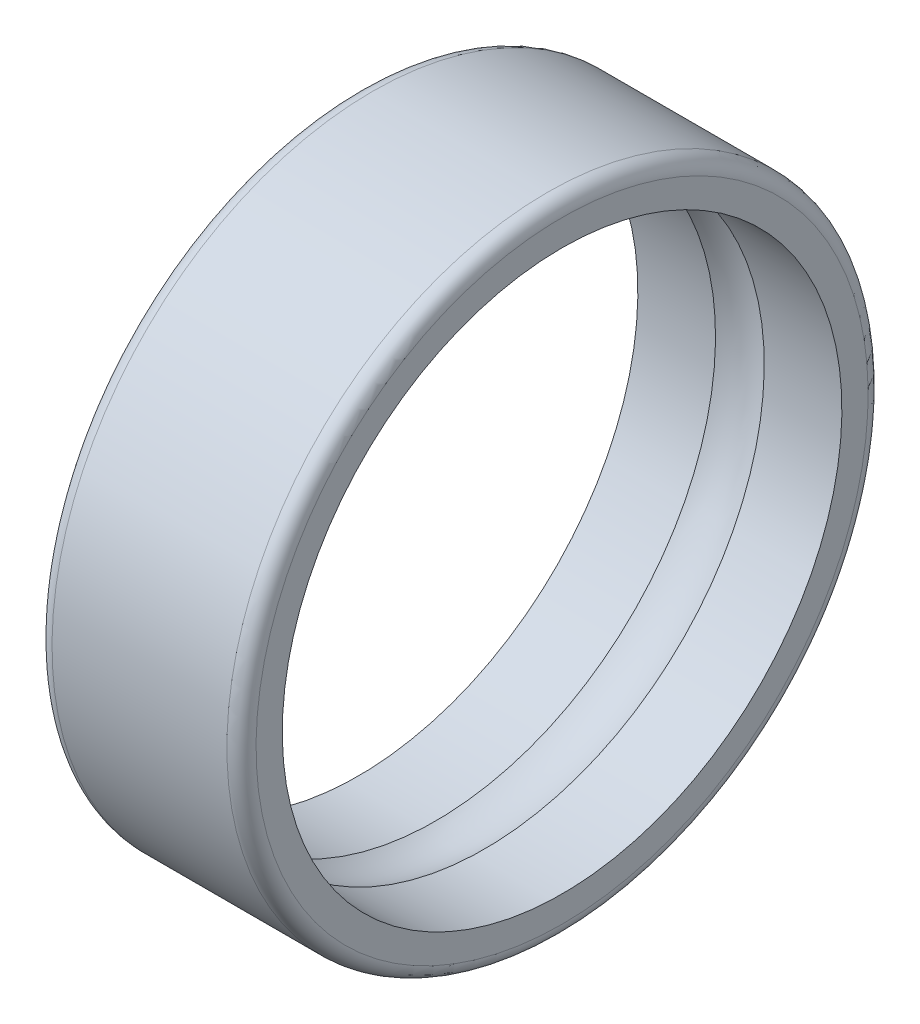
ISO-10303-21;
HEADER;
FILE_DESCRIPTION(('STEP AP214'),'2;1');
FILE_NAME('part.step','',(''),(''),'','','');
FILE_SCHEMA(('AUTOMOTIVE_DESIGN { 1 0 10303 214 1 1 1 1 }'));
ENDSEC;
DATA;
#1=APPLICATION_CONTEXT('core data for automotive mechanical design processes');
#2=APPLICATION_PROTOCOL_DEFINITION('international standard','automotive_design',2000,#1);
#3=PRODUCT_CONTEXT('',#1,'mechanical');
#4=PRODUCT('Part','Part','',(#3));
#5=PRODUCT_RELATED_PRODUCT_CATEGORY('part','',(#4));
#6=PRODUCT_DEFINITION_FORMATION('','',#4);
#7=PRODUCT_DEFINITION_CONTEXT('part definition',#1,'design');
#8=PRODUCT_DEFINITION('design','',#6,#7);
#9=PRODUCT_DEFINITION_SHAPE('','',#8);
#10=(LENGTH_UNIT() NAMED_UNIT(*) SI_UNIT(.MILLI.,.METRE.));
#11=(NAMED_UNIT(*) PLANE_ANGLE_UNIT() SI_UNIT($,.RADIAN.));
#12=(NAMED_UNIT(*) SI_UNIT($,.STERADIAN.) SOLID_ANGLE_UNIT());
#13=UNCERTAINTY_MEASURE_WITH_UNIT(LENGTH_MEASURE(1.E-05),#10,'distance_accuracy_value','');
#14=(GEOMETRIC_REPRESENTATION_CONTEXT(3) GLOBAL_UNCERTAINTY_ASSIGNED_CONTEXT((#13)) GLOBAL_UNIT_ASSIGNED_CONTEXT((#10,
#11,#12)) REPRESENTATION_CONTEXT('',''));
#15=CARTESIAN_POINT('',(0.,0.,0.));
#16=DIRECTION('',(0.,0.,1.));
#17=DIRECTION('',(1.,0.,0.));
#18=AXIS2_PLACEMENT_3D('',#15,#16,#17);
#19=CARTESIAN_POINT('',(0.,0.,0.));
#20=DIRECTION('',(1.,0.,0.));
#21=DIRECTION('',(0.,1.,0.));
#22=AXIS2_PLACEMENT_3D('',#19,#20,#21);
#23=TOROIDAL_SURFACE('',#22,7.8,1.9845);
#24=CARTESIAN_POINT('',(-0.835607712984986,0.,0.));
#25=DIRECTION('',(1.,0.,0.));
#26=DIRECTION('',(0.,1.,0.));
#27=AXIS2_PLACEMENT_3D('',#24,#25,#26);
#28=CIRCLE('',#27,9.6);
#29=CARTESIAN_POINT('',(-0.835607712984987,9.6,0.));
#30=VERTEX_POINT('',#29);
#31=EDGE_CURVE('E64',#30,#30,#28,.T.);
#32=ORIENTED_EDGE('',*,*,#31,.F.);
#33=EDGE_LOOP('',(#32));
#34=FACE_BOUND('',#33,.T.);
#35=CARTESIAN_POINT('',(0.835607712984986,0.,0.));
#36=DIRECTION('',(1.,0.,0.));
#37=DIRECTION('',(0.,1.,0.));
#38=AXIS2_PLACEMENT_3D('',#35,#36,#37);
#39=CIRCLE('',#38,9.6);
#40=CARTESIAN_POINT('',(0.835607712984984,9.6,0.));
#41=VERTEX_POINT('',#40);
#42=EDGE_CURVE('E55',#41,#41,#39,.T.);
#43=ORIENTED_EDGE('',*,*,#42,.T.);
#44=EDGE_LOOP('',(#43));
#45=FACE_BOUND('',#44,.T.);
#46=ADVANCED_FACE('F35',(#34,#45),#23,.F.);
#47=CARTESIAN_POINT('',(23.6601859567376,0.,0.));
#48=DIRECTION('',(1.,0.,0.));
#49=DIRECTION('',(0.,1.,0.));
#50=AXIS2_PLACEMENT_3D('',#47,#48,#49);
#51=CYLINDRICAL_SURFACE('',#50,9.6);
#52=ORIENTED_EDGE('',*,*,#42,.F.);
#53=EDGE_LOOP('',(#52));
#54=FACE_BOUND('',#53,.T.);
#55=CARTESIAN_POINT('',(3.5,0.,0.));
#56=DIRECTION('',(1.,0.,0.));
#57=DIRECTION('',(0.,1.,0.));
#58=AXIS2_PLACEMENT_3D('',#55,#56,#57);
#59=CIRCLE('',#58,9.6);
#60=CARTESIAN_POINT('',(3.5,9.6,0.));
#61=VERTEX_POINT('',#60);
#62=EDGE_CURVE('E58',#61,#61,#59,.T.);
#63=ORIENTED_EDGE('',*,*,#62,.T.);
#64=EDGE_LOOP('',(#63));
#65=FACE_BOUND('',#64,.T.);
#66=ADVANCED_FACE('F72',(#54,#65),#51,.F.);
#67=CARTESIAN_POINT('',(3.5,0.,0.));
#68=DIRECTION('',(-1.,0.,0.));
#69=DIRECTION('',(0.,-1.,0.));
#70=AXIS2_PLACEMENT_3D('',#67,#68,#69);
#71=PLANE('',#70);
#72=CARTESIAN_POINT('',(3.5,0.,0.));
#73=DIRECTION('',(-1.,0.,0.));
#74=DIRECTION('',(0.,-1.,0.));
#75=AXIS2_PLACEMENT_3D('',#72,#73,#74);
#76=CIRCLE('',#75,10.5);
#77=CARTESIAN_POINT('',(3.5,-10.5,0.));
#78=VERTEX_POINT('',#77);
#79=EDGE_CURVE('E10',#78,#78,#76,.F.);
#80=ORIENTED_EDGE('',*,*,#79,.T.);
#81=EDGE_LOOP('',(#80));
#82=FACE_BOUND('',#81,.T.);
#83=ORIENTED_EDGE('',*,*,#62,.F.);
#84=EDGE_LOOP('',(#83));
#85=FACE_BOUND('',#84,.T.);
#86=ADVANCED_FACE('F78',(#82,#85),#71,.F.);
#87=CARTESIAN_POINT('',(23.6601859567376,0.,0.));
#88=DIRECTION('',(1.,0.,0.));
#89=DIRECTION('',(0.,1.,0.));
#90=AXIS2_PLACEMENT_3D('',#87,#88,#89);
#91=CYLINDRICAL_SURFACE('',#90,11.);
#92=CARTESIAN_POINT('',(-3.,0.,0.));
#93=DIRECTION('',(1.,0.,0.));
#94=DIRECTION('',(0.,1.,0.));
#95=AXIS2_PLACEMENT_3D('',#92,#93,#94);
#96=CIRCLE('',#95,11.);
#97=CARTESIAN_POINT('',(-3.,11.,0.));
#98=VERTEX_POINT('',#97);
#99=EDGE_CURVE('E46',#98,#98,#96,.T.);
#100=ORIENTED_EDGE('',*,*,#99,.T.);
#101=EDGE_LOOP('',(#100));
#102=FACE_BOUND('',#101,.T.);
#103=CARTESIAN_POINT('',(3.,0.,0.));
#104=DIRECTION('',(-1.,0.,0.));
#105=DIRECTION('',(0.,-1.,0.));
#106=AXIS2_PLACEMENT_3D('',#103,#104,#105);
#107=CIRCLE('',#106,11.);
#108=CARTESIAN_POINT('',(3.,-11.,0.));
#109=VERTEX_POINT('',#108);
#110=EDGE_CURVE('E50',#109,#109,#107,.T.);
#111=ORIENTED_EDGE('',*,*,#110,.T.);
#112=EDGE_LOOP('',(#111));
#113=FACE_BOUND('',#112,.T.);
#114=ADVANCED_FACE('F83',(#102,#113),#91,.T.);
#115=CARTESIAN_POINT('',(-3.5,0.,0.));
#116=DIRECTION('',(1.,0.,0.));
#117=DIRECTION('',(0.,1.,0.));
#118=AXIS2_PLACEMENT_3D('',#115,#116,#117);
#119=PLANE('',#118);
#120=CARTESIAN_POINT('',(-3.5,0.,0.));
#121=DIRECTION('',(1.,0.,0.));
#122=DIRECTION('',(0.,1.,0.));
#123=AXIS2_PLACEMENT_3D('',#120,#121,#122);
#124=CIRCLE('',#123,10.5);
#125=CARTESIAN_POINT('',(-3.5,10.5,0.));
#126=VERTEX_POINT('',#125);
#127=EDGE_CURVE('E42',#126,#126,#124,.F.);
#128=ORIENTED_EDGE('',*,*,#127,.T.);
#129=EDGE_LOOP('',(#128));
#130=FACE_BOUND('',#129,.T.);
#131=CARTESIAN_POINT('',(-3.5,0.,0.));
#132=DIRECTION('',(1.,0.,0.));
#133=DIRECTION('',(0.,1.,0.));
#134=AXIS2_PLACEMENT_3D('',#131,#132,#133);
#135=CIRCLE('',#134,9.6);
#136=CARTESIAN_POINT('',(-3.5,9.6,0.));
#137=VERTEX_POINT('',#136);
#138=EDGE_CURVE('E61',#137,#137,#135,.T.);
#139=ORIENTED_EDGE('',*,*,#138,.T.);
#140=EDGE_LOOP('',(#139));
#141=FACE_BOUND('',#140,.T.);
#142=ADVANCED_FACE('F88',(#130,#141),#119,.F.);
#143=ORIENTED_EDGE('',*,*,#138,.F.);
#144=EDGE_LOOP('',(#143));
#145=FACE_BOUND('',#144,.T.);
#146=ORIENTED_EDGE('',*,*,#31,.T.);
#147=EDGE_LOOP('',(#146));
#148=FACE_BOUND('',#147,.T.);
#149=ADVANCED_FACE('F68',(#145,#148),#51,.F.);
#150=CARTESIAN_POINT('',(-3.,0.,0.));
#151=DIRECTION('',(1.,0.,0.));
#152=DIRECTION('',(0.,1.,0.));
#153=AXIS2_PLACEMENT_3D('',#150,#151,#152);
#154=TOROIDAL_SURFACE('',#153,10.5,0.5);
#155=ORIENTED_EDGE('',*,*,#127,.F.);
#156=EDGE_LOOP('',(#155));
#157=FACE_BOUND('',#156,.T.);
#158=ORIENTED_EDGE('',*,*,#99,.F.);
#159=EDGE_LOOP('',(#158));
#160=FACE_BOUND('',#159,.T.);
#161=ADVANCED_FACE('F92',(#157,#160),#154,.T.);
#162=CARTESIAN_POINT('',(3.,0.,0.));
#163=DIRECTION('',(-1.,0.,0.));
#164=DIRECTION('',(0.,-1.,0.));
#165=AXIS2_PLACEMENT_3D('',#162,#163,#164);
#166=TOROIDAL_SURFACE('',#165,10.5,0.5);
#167=ORIENTED_EDGE('',*,*,#110,.F.);
#168=EDGE_LOOP('',(#167));
#169=FACE_BOUND('',#168,.T.);
#170=ORIENTED_EDGE('',*,*,#79,.F.);
#171=EDGE_LOOP('',(#170));
#172=FACE_BOUND('',#171,.T.);
#173=ADVANCED_FACE('F37',(#169,#172),#166,.T.);
#174=CLOSED_SHELL('',(#46,#66,#86,#114,#142,#149,#161,#173));
#175=MANIFOLD_SOLID_BREP('B2',#174);
#176=ADVANCED_BREP_SHAPE_REPRESENTATION('',(#18,#175),#14);
#177=SHAPE_DEFINITION_REPRESENTATION(#9,#176);
ENDSEC;
END-ISO-10303-21;
